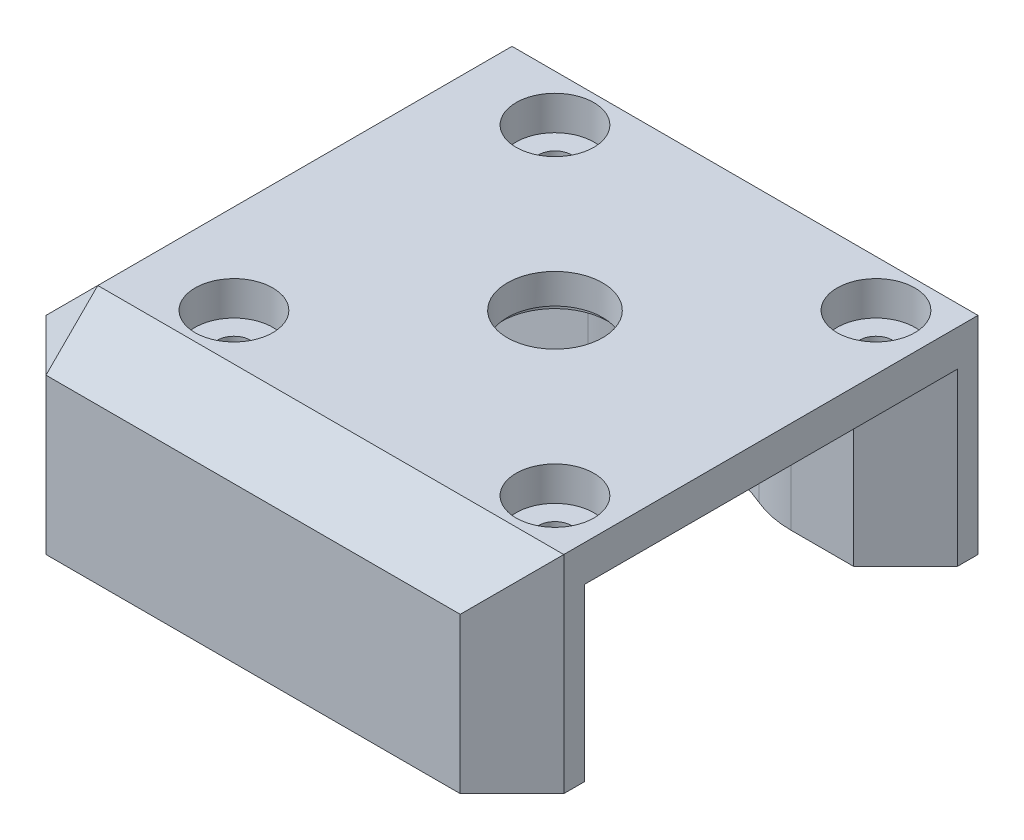
ISO-10303-21;
HEADER;
FILE_DESCRIPTION(('STEP AP214'),'2;1');
FILE_NAME('part.step','',(''),(''),'','','');
FILE_SCHEMA(('AUTOMOTIVE_DESIGN { 1 0 10303 214 1 1 1 1 }'));
ENDSEC;
DATA;
#1=APPLICATION_CONTEXT('core data for automotive mechanical design processes');
#2=APPLICATION_PROTOCOL_DEFINITION('international standard','automotive_design',2000,#1);
#3=PRODUCT_CONTEXT('',#1,'mechanical');
#4=PRODUCT('Part','Part','',(#3));
#5=PRODUCT_RELATED_PRODUCT_CATEGORY('part','',(#4));
#6=PRODUCT_DEFINITION_FORMATION('','',#4);
#7=PRODUCT_DEFINITION_CONTEXT('part definition',#1,'design');
#8=PRODUCT_DEFINITION('design','',#6,#7);
#9=PRODUCT_DEFINITION_SHAPE('','',#8);
#10=(LENGTH_UNIT() NAMED_UNIT(*) SI_UNIT(.MILLI.,.METRE.));
#11=(NAMED_UNIT(*) PLANE_ANGLE_UNIT() SI_UNIT($,.RADIAN.));
#12=(NAMED_UNIT(*) SI_UNIT($,.STERADIAN.) SOLID_ANGLE_UNIT());
#13=UNCERTAINTY_MEASURE_WITH_UNIT(LENGTH_MEASURE(1.E-05),#10,'distance_accuracy_value','');
#14=(GEOMETRIC_REPRESENTATION_CONTEXT(3) GLOBAL_UNCERTAINTY_ASSIGNED_CONTEXT((#13)) GLOBAL_UNIT_ASSIGNED_CONTEXT((#10,
#11,#12)) REPRESENTATION_CONTEXT('',''));
#15=CARTESIAN_POINT('',(0.,0.,0.));
#16=DIRECTION('',(0.,0.,1.));
#17=DIRECTION('',(1.,0.,0.));
#18=AXIS2_PLACEMENT_3D('',#15,#16,#17);
#19=CARTESIAN_POINT('',(5.,16.5,-12.));
#20=DIRECTION('',(0.,0.,1.));
#21=DIRECTION('',(1.,0.,0.));
#22=AXIS2_PLACEMENT_3D('',#19,#20,#21);
#23=PLANE('',#22);
#24=DIRECTION('',(-1.,0.,0.));
#25=VECTOR('',#24,1.);
#26=CARTESIAN_POINT('',(5.,16.5,-12.));
#27=LINE('',#26,#25);
#28=CARTESIAN_POINT('',(19.3520410288675,16.5,-12.));
#29=VERTEX_POINT('',#28);
#30=CARTESIAN_POINT('',(5.,16.5,-12.));
#31=VERTEX_POINT('',#30);
#32=EDGE_CURVE('E218',#29,#31,#27,.T.);
#33=ORIENTED_EDGE('',*,*,#32,.F.);
#34=DIRECTION('',(0.,-1.,0.));
#35=VECTOR('',#34,1.);
#36=CARTESIAN_POINT('',(19.3520410288675,16.5,-12.));
#37=LINE('',#36,#35);
#38=CARTESIAN_POINT('',(19.3520410288675,0.,-12.));
#39=VERTEX_POINT('',#38);
#40=EDGE_CURVE('E328',#29,#39,#37,.T.);
#41=ORIENTED_EDGE('',*,*,#40,.T.);
#42=DIRECTION('',(-1.,0.,0.));
#43=VECTOR('',#42,1.);
#44=CARTESIAN_POINT('',(5.,0.,-12.));
#45=LINE('',#44,#43);
#46=CARTESIAN_POINT('',(5.,0.,-12.));
#47=VERTEX_POINT('',#46);
#48=EDGE_CURVE('E223',#39,#47,#45,.T.);
#49=ORIENTED_EDGE('',*,*,#48,.T.);
#50=DIRECTION('',(0.,-1.,0.));
#51=VECTOR('',#50,1.);
#52=CARTESIAN_POINT('',(5.,16.5,-12.));
#53=LINE('',#52,#51);
#54=EDGE_CURVE('E204',#31,#47,#53,.T.);
#55=ORIENTED_EDGE('',*,*,#54,.F.);
#56=EDGE_LOOP('',(#33,#41,#49,#55));
#57=FACE_BOUND('',#56,.T.);
#58=ADVANCED_FACE('F41',(#57),#23,.F.);
#59=CARTESIAN_POINT('',(5.,16.5,-38.));
#60=DIRECTION('',(0.,0.,-1.));
#61=DIRECTION('',(-1.,0.,0.));
#62=AXIS2_PLACEMENT_3D('',#59,#60,#61);
#63=PLANE('',#62);
#64=DIRECTION('',(1.,0.,0.));
#65=VECTOR('',#64,1.);
#66=CARTESIAN_POINT('',(5.,16.5,-38.));
#67=LINE('',#66,#65);
#68=CARTESIAN_POINT('',(38.9479589711328,16.5,-38.));
#69=VERTEX_POINT('',#68);
#70=CARTESIAN_POINT('',(45.,16.5,-38.));
#71=VERTEX_POINT('',#70);
#72=EDGE_CURVE('E213',#69,#71,#67,.T.);
#73=ORIENTED_EDGE('',*,*,#72,.F.);
#74=DIRECTION('',(0.,-1.,0.));
#75=VECTOR('',#74,1.);
#76=CARTESIAN_POINT('',(38.9479589711328,16.5,-38.));
#77=LINE('',#76,#75);
#78=CARTESIAN_POINT('',(38.9479589711328,0.,-38.));
#79=VERTEX_POINT('',#78);
#80=EDGE_CURVE('E389',#69,#79,#77,.T.);
#81=ORIENTED_EDGE('',*,*,#80,.T.);
#82=DIRECTION('',(1.,0.,0.));
#83=VECTOR('',#82,1.);
#84=CARTESIAN_POINT('',(5.,0.,-38.));
#85=LINE('',#84,#83);
#86=CARTESIAN_POINT('',(45.,0.,-38.));
#87=VERTEX_POINT('',#86);
#88=EDGE_CURVE('E233',#79,#87,#85,.T.);
#89=ORIENTED_EDGE('',*,*,#88,.T.);
#90=DIRECTION('',(0.,1.,0.));
#91=VECTOR('',#90,1.);
#92=CARTESIAN_POINT('',(45.,16.5,-38.));
#93=LINE('',#92,#91);
#94=EDGE_CURVE('E292',#87,#71,#93,.T.);
#95=ORIENTED_EDGE('',*,*,#94,.T.);
#96=EDGE_LOOP('',(#73,#81,#89,#95));
#97=FACE_BOUND('',#96,.T.);
#98=ADVANCED_FACE('F498',(#97),#63,.F.);
#99=CARTESIAN_POINT('',(13.65,20.,-40.5));
#100=DIRECTION('',(0.,-1.,0.));
#101=DIRECTION('',(0.,0.,-1.));
#102=AXIS2_PLACEMENT_3D('',#99,#100,#101);
#103=CYLINDRICAL_SURFACE('',#102,1.6);
#104=CARTESIAN_POINT('',(13.65,0.,-40.5));
#105=DIRECTION('',(0.,1.,0.));
#106=DIRECTION('',(0.,0.,1.));
#107=AXIS2_PLACEMENT_3D('',#104,#105,#106);
#108=CIRCLE('',#107,1.6);
#109=CARTESIAN_POINT('',(13.65,0.,-38.9));
#110=VERTEX_POINT('',#109);
#111=EDGE_CURVE('E246',#110,#110,#108,.T.);
#112=ORIENTED_EDGE('',*,*,#111,.F.);
#113=EDGE_LOOP('',(#112));
#114=FACE_BOUND('',#113,.T.);
#115=CARTESIAN_POINT('',(13.65,16.7,-40.5));
#116=DIRECTION('',(0.,1.,0.));
#117=DIRECTION('',(0.,0.,1.));
#118=AXIS2_PLACEMENT_3D('',#115,#116,#117);
#119=CIRCLE('',#118,1.6);
#120=CARTESIAN_POINT('',(13.65,16.7,-38.9));
#121=VERTEX_POINT('',#120);
#122=EDGE_CURVE('E333',#121,#121,#119,.T.);
#123=ORIENTED_EDGE('',*,*,#122,.T.);
#124=EDGE_LOOP('',(#123));
#125=FACE_BOUND('',#124,.T.);
#126=ADVANCED_FACE('F505',(#114,#125),#103,.F.);
#127=CARTESIAN_POINT('',(44.65,20.,-40.5));
#128=DIRECTION('',(0.,-1.,0.));
#129=DIRECTION('',(0.,0.,-1.));
#130=AXIS2_PLACEMENT_3D('',#127,#128,#129);
#131=CYLINDRICAL_SURFACE('',#130,1.6);
#132=CARTESIAN_POINT('',(44.65,0.,-40.5));
#133=DIRECTION('',(0.,1.,0.));
#134=DIRECTION('',(0.,0.,1.));
#135=AXIS2_PLACEMENT_3D('',#132,#133,#134);
#136=CIRCLE('',#135,1.6);
#137=CARTESIAN_POINT('',(44.65,0.,-38.9));
#138=VERTEX_POINT('',#137);
#139=EDGE_CURVE('E243',#138,#138,#136,.T.);
#140=ORIENTED_EDGE('',*,*,#139,.F.);
#141=EDGE_LOOP('',(#140));
#142=FACE_BOUND('',#141,.T.);
#143=CARTESIAN_POINT('',(44.65,16.7,-40.5));
#144=DIRECTION('',(0.,1.,0.));
#145=DIRECTION('',(0.,0.,1.));
#146=AXIS2_PLACEMENT_3D('',#143,#144,#145);
#147=CIRCLE('',#146,1.6);
#148=CARTESIAN_POINT('',(44.65,16.7,-38.9));
#149=VERTEX_POINT('',#148);
#150=EDGE_CURVE('E362',#149,#149,#147,.T.);
#151=ORIENTED_EDGE('',*,*,#150,.T.);
#152=EDGE_LOOP('',(#151));
#153=FACE_BOUND('',#152,.T.);
#154=ADVANCED_FACE('F530',(#142,#153),#131,.F.);
#155=CARTESIAN_POINT('',(44.6500000000003,20.,-9.5));
#156=DIRECTION('',(0.,-1.,0.));
#157=DIRECTION('',(0.,0.,-1.));
#158=AXIS2_PLACEMENT_3D('',#155,#156,#157);
#159=CYLINDRICAL_SURFACE('',#158,1.6);
#160=CARTESIAN_POINT('',(44.6500000000003,0.,-9.5));
#161=DIRECTION('',(0.,1.,0.));
#162=DIRECTION('',(0.,0.,1.));
#163=AXIS2_PLACEMENT_3D('',#160,#161,#162);
#164=CIRCLE('',#163,1.6);
#165=CARTESIAN_POINT('',(44.6500000000003,0.,-7.9));
#166=VERTEX_POINT('',#165);
#167=EDGE_CURVE('E240',#166,#166,#164,.T.);
#168=ORIENTED_EDGE('',*,*,#167,.F.);
#169=EDGE_LOOP('',(#168));
#170=FACE_BOUND('',#169,.T.);
#171=CARTESIAN_POINT('',(44.6500000000003,16.7,-9.5));
#172=DIRECTION('',(0.,1.,0.));
#173=DIRECTION('',(0.,0.,1.));
#174=AXIS2_PLACEMENT_3D('',#171,#172,#173);
#175=CIRCLE('',#174,1.6);
#176=CARTESIAN_POINT('',(44.6500000000003,16.7,-7.9));
#177=VERTEX_POINT('',#176);
#178=EDGE_CURVE('E358',#177,#177,#175,.T.);
#179=ORIENTED_EDGE('',*,*,#178,.T.);
#180=EDGE_LOOP('',(#179));
#181=FACE_BOUND('',#180,.T.);
#182=ADVANCED_FACE('F526',(#170,#181),#159,.F.);
#183=CARTESIAN_POINT('',(13.6500000000003,20.,-9.5));
#184=DIRECTION('',(0.,-1.,0.));
#185=DIRECTION('',(0.,0.,-1.));
#186=AXIS2_PLACEMENT_3D('',#183,#184,#185);
#187=CYLINDRICAL_SURFACE('',#186,1.6);
#188=CARTESIAN_POINT('',(13.6500000000003,0.,-9.5));
#189=DIRECTION('',(0.,1.,0.));
#190=DIRECTION('',(0.,0.,1.));
#191=AXIS2_PLACEMENT_3D('',#188,#189,#190);
#192=CIRCLE('',#191,1.6);
#193=CARTESIAN_POINT('',(13.6500000000003,0.,-7.9));
#194=VERTEX_POINT('',#193);
#195=EDGE_CURVE('E236',#194,#194,#192,.T.);
#196=ORIENTED_EDGE('',*,*,#195,.F.);
#197=EDGE_LOOP('',(#196));
#198=FACE_BOUND('',#197,.T.);
#199=CARTESIAN_POINT('',(13.6500000000003,16.7,-9.5));
#200=DIRECTION('',(0.,1.,0.));
#201=DIRECTION('',(0.,0.,1.));
#202=AXIS2_PLACEMENT_3D('',#199,#200,#201);
#203=CIRCLE('',#202,1.6);
#204=CARTESIAN_POINT('',(13.6500000000003,16.7,-7.9));
#205=VERTEX_POINT('',#204);
#206=EDGE_CURVE('E355',#205,#205,#203,.T.);
#207=ORIENTED_EDGE('',*,*,#206,.T.);
#208=EDGE_LOOP('',(#207));
#209=FACE_BOUND('',#208,.T.);
#210=ADVANCED_FACE('F522',(#198,#209),#187,.F.);
#211=CARTESIAN_POINT('',(29.1500000000002,5.,-25.));
#212=DIRECTION('',(0.,1.,0.));
#213=DIRECTION('',(0.,0.,1.));
#214=AXIS2_PLACEMENT_3D('',#211,#212,#213);
#215=CYLINDRICAL_SURFACE('',#214,4.6);
#216=CARTESIAN_POINT('',(29.1500000000002,20.,-25.));
#217=DIRECTION('',(0.,1.,0.));
#218=DIRECTION('',(0.,0.,1.));
#219=AXIS2_PLACEMENT_3D('',#216,#217,#218);
#220=CIRCLE('',#219,4.6);
#221=CARTESIAN_POINT('',(29.1500000000002,20.,-20.4));
#222=VERTEX_POINT('',#221);
#223=EDGE_CURVE('E226',#222,#222,#220,.T.);
#224=ORIENTED_EDGE('',*,*,#223,.T.);
#225=EDGE_LOOP('',(#224));
#226=FACE_BOUND('',#225,.T.);
#227=CARTESIAN_POINT('',(29.1500000000002,17.1,-25.));
#228=DIRECTION('',(0.,-1.,0.));
#229=DIRECTION('',(0.,0.,-1.));
#230=AXIS2_PLACEMENT_3D('',#227,#228,#229);
#231=CIRCLE('',#230,4.6);
#232=CARTESIAN_POINT('',(29.1500000000002,17.1,-29.6));
#233=VERTEX_POINT('',#232);
#234=EDGE_CURVE('E266',#233,#233,#231,.F.);
#235=ORIENTED_EDGE('',*,*,#234,.F.);
#236=EDGE_LOOP('',(#235));
#237=FACE_BOUND('',#236,.T.);
#238=ADVANCED_FACE('F525',(#226,#237),#215,.F.);
#239=CARTESIAN_POINT('',(0.,20.,0.));
#240=DIRECTION('',(0.,-1.,0.));
#241=DIRECTION('',(0.,0.,-1.));
#242=AXIS2_PLACEMENT_3D('',#239,#240,#241);
#243=PLANE('',#242);
#244=CARTESIAN_POINT('',(13.6500000000003,20.,-9.5));
#245=DIRECTION('',(0.,1.,0.));
#246=DIRECTION('',(0.,0.,1.));
#247=AXIS2_PLACEMENT_3D('',#244,#245,#246);
#248=CIRCLE('',#247,3.75);
#249=CARTESIAN_POINT('',(13.6500000000003,20.,-5.75));
#250=VERTEX_POINT('',#249);
#251=EDGE_CURVE('E408',#250,#250,#248,.T.);
#252=ORIENTED_EDGE('',*,*,#251,.F.);
#253=EDGE_LOOP('',(#252));
#254=FACE_BOUND('',#253,.T.);
#255=CARTESIAN_POINT('',(44.6500000000003,20.,-9.5));
#256=DIRECTION('',(0.,1.,0.));
#257=DIRECTION('',(0.,0.,1.));
#258=AXIS2_PLACEMENT_3D('',#255,#256,#257);
#259=CIRCLE('',#258,3.75);
#260=CARTESIAN_POINT('',(44.6500000000003,20.,-5.75));
#261=VERTEX_POINT('',#260);
#262=EDGE_CURVE('E606',#261,#261,#259,.T.);
#263=ORIENTED_EDGE('',*,*,#262,.F.);
#264=EDGE_LOOP('',(#263));
#265=FACE_BOUND('',#264,.T.);
#266=CARTESIAN_POINT('',(44.65,20.,-40.5));
#267=DIRECTION('',(0.,1.,0.));
#268=DIRECTION('',(0.,0.,1.));
#269=AXIS2_PLACEMENT_3D('',#266,#267,#268);
#270=CIRCLE('',#269,3.75);
#271=CARTESIAN_POINT('',(44.65,20.,-36.75));
#272=VERTEX_POINT('',#271);
#273=EDGE_CURVE('E600',#272,#272,#270,.T.);
#274=ORIENTED_EDGE('',*,*,#273,.F.);
#275=EDGE_LOOP('',(#274));
#276=FACE_BOUND('',#275,.T.);
#277=CARTESIAN_POINT('',(13.65,20.,-40.5));
#278=DIRECTION('',(0.,1.,0.));
#279=DIRECTION('',(0.,0.,1.));
#280=AXIS2_PLACEMENT_3D('',#277,#278,#279);
#281=CIRCLE('',#280,3.75);
#282=CARTESIAN_POINT('',(13.65,20.,-36.75));
#283=VERTEX_POINT('',#282);
#284=EDGE_CURVE('E599',#283,#283,#281,.T.);
#285=ORIENTED_EDGE('',*,*,#284,.F.);
#286=EDGE_LOOP('',(#285));
#287=FACE_BOUND('',#286,.T.);
#288=ORIENTED_EDGE('',*,*,#223,.F.);
#289=EDGE_LOOP('',(#288));
#290=FACE_BOUND('',#289,.T.);
#291=DIRECTION('',(0.,0.,-1.));
#292=VECTOR('',#291,1.);
#293=CARTESIAN_POINT('',(50.,20.,0.));
#294=LINE('',#293,#292);
#295=CARTESIAN_POINT('',(50.,20.,-5.00000000000002));
#296=VERTEX_POINT('',#295);
#297=CARTESIAN_POINT('',(50.,20.,-45.));
#298=VERTEX_POINT('',#297);
#299=EDGE_CURVE('E250',#296,#298,#294,.T.);
#300=ORIENTED_EDGE('',*,*,#299,.T.);
#301=DIRECTION('',(-1.,0.,0.));
#302=VECTOR('',#301,1.);
#303=CARTESIAN_POINT('',(0.,20.,-45.));
#304=LINE('',#303,#302);
#305=CARTESIAN_POINT('',(5.,20.,-45.));
#306=VERTEX_POINT('',#305);
#307=EDGE_CURVE('E309',#298,#306,#304,.T.);
#308=ORIENTED_EDGE('',*,*,#307,.T.);
#309=DIRECTION('',(0.,0.,1.));
#310=VECTOR('',#309,1.);
#311=CARTESIAN_POINT('',(5.,20.,0.));
#312=LINE('',#311,#310);
#313=CARTESIAN_POINT('',(5.,20.,-5.00000000000002));
#314=VERTEX_POINT('',#313);
#315=EDGE_CURVE('E307',#306,#314,#312,.T.);
#316=ORIENTED_EDGE('',*,*,#315,.T.);
#317=DIRECTION('',(1.,0.,0.));
#318=VECTOR('',#317,1.);
#319=CARTESIAN_POINT('',(0.,20.,-5.00000000000002));
#320=LINE('',#319,#318);
#321=EDGE_CURVE('E305',#314,#296,#320,.T.);
#322=ORIENTED_EDGE('',*,*,#321,.T.);
#323=EDGE_LOOP('',(#300,#308,#316,#322));
#324=FACE_BOUND('',#323,.T.);
#325=ADVANCED_FACE('F538',(#254,#265,#276,#287,#290,#324),#243,.F.);
#326=CARTESIAN_POINT('',(0.,0.,0.));
#327=DIRECTION('',(0.,-1.,0.));
#328=DIRECTION('',(0.,0.,-1.));
#329=AXIS2_PLACEMENT_3D('',#326,#327,#328);
#330=PLANE('',#329);
#331=ORIENTED_EDGE('',*,*,#48,.F.);
#332=CARTESIAN_POINT('',(19.3520410288675,0.,-2.));
#333=DIRECTION('',(0.,-1.,0.));
#334=DIRECTION('',(0.,0.,-1.));
#335=AXIS2_PLACEMENT_3D('',#332,#333,#334);
#336=CIRCLE('',#335,10.);
#337=CARTESIAN_POINT('',(23.2712246173205,0.,-11.2));
#338=VERTEX_POINT('',#337);
#339=EDGE_CURVE('E375',#39,#338,#336,.T.);
#340=ORIENTED_EDGE('',*,*,#339,.T.);
#341=CARTESIAN_POINT('',(29.1500000000002,0.,-25.));
#342=DIRECTION('',(0.,-1.,0.));
#343=DIRECTION('',(0.,0.,-1.));
#344=AXIS2_PLACEMENT_3D('',#341,#342,#343);
#345=CIRCLE('',#344,15.);
#346=CARTESIAN_POINT('',(35.0287753826798,0.,-11.2));
#347=VERTEX_POINT('',#346);
#348=EDGE_CURVE('E418',#347,#338,#345,.T.);
#349=ORIENTED_EDGE('',*,*,#348,.F.);
#350=CARTESIAN_POINT('',(38.9479589711329,0.,-2.));
#351=DIRECTION('',(0.,-1.,0.));
#352=DIRECTION('',(0.,0.,-1.));
#353=AXIS2_PLACEMENT_3D('',#350,#351,#352);
#354=CIRCLE('',#353,10.);
#355=CARTESIAN_POINT('',(38.9479589711328,0.,-12.));
#356=VERTEX_POINT('',#355);
#357=EDGE_CURVE('E373',#347,#356,#354,.T.);
#358=ORIENTED_EDGE('',*,*,#357,.T.);
#359=CARTESIAN_POINT('',(45.,0.,-12.));
#360=VERTEX_POINT('',#359);
#361=EDGE_CURVE('E220',#360,#356,#45,.T.);
#362=ORIENTED_EDGE('',*,*,#361,.F.);
#363=DIRECTION('',(-0.707106781186546,0.,-0.707106781186549));
#364=VECTOR('',#363,1.);
#365=CARTESIAN_POINT('',(28.5000000000001,0.,-28.5));
#366=LINE('',#365,#364);
#367=CARTESIAN_POINT('',(50.,0.,-6.99999999999999));
#368=VERTEX_POINT('',#367);
#369=EDGE_CURVE('E287',#360,#368,#366,.F.);
#370=ORIENTED_EDGE('',*,*,#369,.T.);
#371=DIRECTION('',(0.,0.,-1.));
#372=VECTOR('',#371,1.);
#373=CARTESIAN_POINT('',(50.,0.,0.));
#374=LINE('',#373,#372);
#375=CARTESIAN_POINT('',(50.,0.,-5.00000000000002));
#376=VERTEX_POINT('',#375);
#377=EDGE_CURVE('E263',#376,#368,#374,.T.);
#378=ORIENTED_EDGE('',*,*,#377,.F.);
#379=DIRECTION('',(0.707106781186547,0.,-0.707106781186549));
#380=VECTOR('',#379,1.);
#381=CARTESIAN_POINT('',(22.5000000000001,0.,22.5));
#382=LINE('',#381,#380);
#383=CARTESIAN_POINT('',(45.,0.,0.));
#384=VERTEX_POINT('',#383);
#385=EDGE_CURVE('E281',#376,#384,#382,.F.);
#386=ORIENTED_EDGE('',*,*,#385,.T.);
#387=DIRECTION('',(1.,0.,0.));
#388=VECTOR('',#387,1.);
#389=CARTESIAN_POINT('',(0.,0.,0.));
#390=LINE('',#389,#388);
#391=CARTESIAN_POINT('',(5.,0.,0.));
#392=VERTEX_POINT('',#391);
#393=EDGE_CURVE('E257',#392,#384,#390,.T.);
#394=ORIENTED_EDGE('',*,*,#393,.F.);
#395=DIRECTION('',(0.707106781186547,0.,0.707106781186549));
#396=VECTOR('',#395,1.);
#397=CARTESIAN_POINT('',(2.50000000000001,0.,-2.5));
#398=LINE('',#397,#396);
#399=CARTESIAN_POINT('',(0.,0.,-5.00000000000002));
#400=VERTEX_POINT('',#399);
#401=EDGE_CURVE('E279',#392,#400,#398,.F.);
#402=ORIENTED_EDGE('',*,*,#401,.T.);
#403=DIRECTION('',(0.,0.,1.));
#404=VECTOR('',#403,1.);
#405=CARTESIAN_POINT('',(0.,0.,0.));
#406=LINE('',#405,#404);
#407=CARTESIAN_POINT('',(0.,0.,-45.));
#408=VERTEX_POINT('',#407);
#409=EDGE_CURVE('E249',#408,#400,#406,.T.);
#410=ORIENTED_EDGE('',*,*,#409,.F.);
#411=DIRECTION('',(-0.707106781186547,0.,0.707106781186549));
#412=VECTOR('',#411,1.);
#413=CARTESIAN_POINT('',(-22.5,0.,-22.4999999999999));
#414=LINE('',#413,#412);
#415=CARTESIAN_POINT('',(5.,0.,-50.));
#416=VERTEX_POINT('',#415);
#417=EDGE_CURVE('E283',#408,#416,#414,.F.);
#418=ORIENTED_EDGE('',*,*,#417,.T.);
#419=DIRECTION('',(-1.,0.,0.));
#420=VECTOR('',#419,1.);
#421=CARTESIAN_POINT('',(0.,0.,-50.));
#422=LINE('',#421,#420);
#423=CARTESIAN_POINT('',(45.,0.,-50.));
#424=VERTEX_POINT('',#423);
#425=EDGE_CURVE('E254',#424,#416,#422,.T.);
#426=ORIENTED_EDGE('',*,*,#425,.F.);
#427=DIRECTION('',(-0.707106781186547,0.,-0.707106781186549));
#428=VECTOR('',#427,1.);
#429=CARTESIAN_POINT('',(47.5000000000001,0.,-47.4999999999999));
#430=LINE('',#429,#428);
#431=CARTESIAN_POINT('',(50.,0.,-45.));
#432=VERTEX_POINT('',#431);
#433=EDGE_CURVE('E285',#424,#432,#430,.F.);
#434=ORIENTED_EDGE('',*,*,#433,.T.);
#435=CARTESIAN_POINT('',(50.,0.,-43.));
#436=VERTEX_POINT('',#435);
#437=EDGE_CURVE('E260',#436,#432,#374,.T.);
#438=ORIENTED_EDGE('',*,*,#437,.F.);
#439=DIRECTION('',(0.707106781186549,0.,-0.707106781186546));
#440=VECTOR('',#439,1.);
#441=CARTESIAN_POINT('',(3.49999999999989,0.,3.49999999999991));
#442=LINE('',#441,#440);
#443=EDGE_CURVE('E289',#436,#87,#442,.F.);
#444=ORIENTED_EDGE('',*,*,#443,.T.);
#445=ORIENTED_EDGE('',*,*,#88,.F.);
#446=CARTESIAN_POINT('',(38.9479589711328,0.,-48.));
#447=DIRECTION('',(0.,-1.,0.));
#448=DIRECTION('',(0.,0.,-1.));
#449=AXIS2_PLACEMENT_3D('',#446,#447,#448);
#450=CIRCLE('',#449,10.);
#451=CARTESIAN_POINT('',(35.0287753826798,0.,-38.8));
#452=VERTEX_POINT('',#451);
#453=EDGE_CURVE('E369',#79,#452,#450,.T.);
#454=ORIENTED_EDGE('',*,*,#453,.T.);
#455=CARTESIAN_POINT('',(23.2712246173206,0.,-38.8));
#456=VERTEX_POINT('',#455);
#457=EDGE_CURVE('E590',#456,#452,#345,.T.);
#458=ORIENTED_EDGE('',*,*,#457,.F.);
#459=CARTESIAN_POINT('',(19.3520410288675,0.,-48.));
#460=DIRECTION('',(0.,-1.,0.));
#461=DIRECTION('',(0.,0.,-1.));
#462=AXIS2_PLACEMENT_3D('',#459,#460,#461);
#463=CIRCLE('',#462,10.);
#464=CARTESIAN_POINT('',(19.3520410288675,0.,-38.));
#465=VERTEX_POINT('',#464);
#466=EDGE_CURVE('E371',#456,#465,#463,.T.);
#467=ORIENTED_EDGE('',*,*,#466,.T.);
#468=CARTESIAN_POINT('',(5.,0.,-38.));
#469=VERTEX_POINT('',#468);
#470=EDGE_CURVE('E234',#469,#465,#85,.T.);
#471=ORIENTED_EDGE('',*,*,#470,.F.);
#472=DIRECTION('',(0.,0.,-1.));
#473=VECTOR('',#472,1.);
#474=CARTESIAN_POINT('',(5.,0.,-12.));
#475=LINE('',#474,#473);
#476=EDGE_CURVE('E200',#47,#469,#475,.T.);
#477=ORIENTED_EDGE('',*,*,#476,.F.);
#478=EDGE_LOOP('',(#331,#340,#349,#358,#362,#370,#378,#386,#394,#402,#410,#418,#426,#434,#438,
#444,#445,#454,#458,#467,#471,#477));
#479=FACE_BOUND('',#478,.T.);
#480=ORIENTED_EDGE('',*,*,#167,.T.);
#481=EDGE_LOOP('',(#480));
#482=FACE_BOUND('',#481,.T.);
#483=ORIENTED_EDGE('',*,*,#111,.T.);
#484=EDGE_LOOP('',(#483));
#485=FACE_BOUND('',#484,.T.);
#486=ORIENTED_EDGE('',*,*,#139,.T.);
#487=EDGE_LOOP('',(#486));
#488=FACE_BOUND('',#487,.T.);
#489=ORIENTED_EDGE('',*,*,#195,.T.);
#490=EDGE_LOOP('',(#489));
#491=FACE_BOUND('',#490,.T.);
#492=ADVANCED_FACE('F416',(#479,#482,#485,#488,#491),#330,.T.);
#493=CARTESIAN_POINT('',(0.,20.,0.));
#494=DIRECTION('',(1.,0.,0.));
#495=DIRECTION('',(0.,0.,-1.));
#496=AXIS2_PLACEMENT_3D('',#493,#494,#495);
#497=PLANE('',#496);
#498=DIRECTION('',(0.,0.,-1.));
#499=VECTOR('',#498,1.);
#500=CARTESIAN_POINT('',(0.,15.,0.));
#501=LINE('',#500,#499);
#502=CARTESIAN_POINT('',(0.,15.,-5.00000000000002));
#503=VERTEX_POINT('',#502);
#504=CARTESIAN_POINT('',(0.,15.,-45.));
#505=VERTEX_POINT('',#504);
#506=EDGE_CURVE('E313',#503,#505,#501,.T.);
#507=ORIENTED_EDGE('',*,*,#506,.T.);
#508=DIRECTION('',(0.,-1.,0.));
#509=VECTOR('',#508,1.);
#510=CARTESIAN_POINT('',(0.,20.,-45.));
#511=LINE('',#510,#509);
#512=EDGE_CURVE('E315',#505,#408,#511,.T.);
#513=ORIENTED_EDGE('',*,*,#512,.T.);
#514=ORIENTED_EDGE('',*,*,#409,.T.);
#515=DIRECTION('',(0.,1.,0.));
#516=VECTOR('',#515,1.);
#517=CARTESIAN_POINT('',(0.,20.,-5.00000000000002));
#518=LINE('',#517,#516);
#519=EDGE_CURVE('E311',#400,#503,#518,.T.);
#520=ORIENTED_EDGE('',*,*,#519,.T.);
#521=EDGE_LOOP('',(#507,#513,#514,#520));
#522=FACE_BOUND('',#521,.T.);
#523=ADVANCED_FACE('F455',(#522),#497,.F.);
#524=CARTESIAN_POINT('',(0.,20.,0.));
#525=DIRECTION('',(0.,0.,-1.));
#526=DIRECTION('',(-1.,0.,0.));
#527=AXIS2_PLACEMENT_3D('',#524,#525,#526);
#528=PLANE('',#527);
#529=ORIENTED_EDGE('',*,*,#393,.T.);
#530=DIRECTION('',(0.,1.,0.));
#531=VECTOR('',#530,1.);
#532=CARTESIAN_POINT('',(45.,20.,0.));
#533=LINE('',#532,#531);
#534=CARTESIAN_POINT('',(45.,15.,0.));
#535=VERTEX_POINT('',#534);
#536=EDGE_CURVE('E321',#384,#535,#533,.T.);
#537=ORIENTED_EDGE('',*,*,#536,.T.);
#538=DIRECTION('',(-1.,0.,0.));
#539=VECTOR('',#538,1.);
#540=CARTESIAN_POINT('',(0.,15.,0.));
#541=LINE('',#540,#539);
#542=CARTESIAN_POINT('',(5.,15.,0.));
#543=VERTEX_POINT('',#542);
#544=EDGE_CURVE('E319',#535,#543,#541,.T.);
#545=ORIENTED_EDGE('',*,*,#544,.T.);
#546=DIRECTION('',(0.,-1.,0.));
#547=VECTOR('',#546,1.);
#548=CARTESIAN_POINT('',(5.,20.,0.));
#549=LINE('',#548,#547);
#550=EDGE_CURVE('E317',#543,#392,#549,.T.);
#551=ORIENTED_EDGE('',*,*,#550,.T.);
#552=EDGE_LOOP('',(#529,#537,#545,#551));
#553=FACE_BOUND('',#552,.T.);
#554=ADVANCED_FACE('F444',(#553),#528,.F.);
#555=CARTESIAN_POINT('',(50.,20.,0.));
#556=DIRECTION('',(-1.,0.,0.));
#557=DIRECTION('',(0.,0.,1.));
#558=AXIS2_PLACEMENT_3D('',#555,#556,#557);
#559=PLANE('',#558);
#560=DIRECTION('',(0.,0.,1.));
#561=VECTOR('',#560,1.);
#562=CARTESIAN_POINT('',(50.,16.5,-12.));
#563=LINE('',#562,#561);
#564=CARTESIAN_POINT('',(50.,16.5,-43.));
#565=VERTEX_POINT('',#564);
#566=CARTESIAN_POINT('',(50.,16.5,-6.99999999999999));
#567=VERTEX_POINT('',#566);
#568=EDGE_CURVE('E212',#565,#567,#563,.T.);
#569=ORIENTED_EDGE('',*,*,#568,.F.);
#570=DIRECTION('',(0.,-1.,0.));
#571=VECTOR('',#570,1.);
#572=CARTESIAN_POINT('',(50.,20.,-43.));
#573=LINE('',#572,#571);
#574=EDGE_CURVE('E276',#565,#436,#573,.T.);
#575=ORIENTED_EDGE('',*,*,#574,.T.);
#576=ORIENTED_EDGE('',*,*,#437,.T.);
#577=DIRECTION('',(0.,1.,0.));
#578=VECTOR('',#577,1.);
#579=CARTESIAN_POINT('',(50.,20.,-45.));
#580=LINE('',#579,#578);
#581=EDGE_CURVE('E271',#432,#298,#580,.T.);
#582=ORIENTED_EDGE('',*,*,#581,.T.);
#583=ORIENTED_EDGE('',*,*,#299,.F.);
#584=DIRECTION('',(0.,-1.,0.));
#585=VECTOR('',#584,1.);
#586=CARTESIAN_POINT('',(50.,20.,-5.00000000000002));
#587=LINE('',#586,#585);
#588=EDGE_CURVE('E253',#296,#376,#587,.T.);
#589=ORIENTED_EDGE('',*,*,#588,.T.);
#590=ORIENTED_EDGE('',*,*,#377,.T.);
#591=DIRECTION('',(0.,1.,0.));
#592=VECTOR('',#591,1.);
#593=CARTESIAN_POINT('',(50.,20.,-6.99999999999999));
#594=LINE('',#593,#592);
#595=EDGE_CURVE('E273',#368,#567,#594,.T.);
#596=ORIENTED_EDGE('',*,*,#595,.T.);
#597=EDGE_LOOP('',(#569,#575,#576,#582,#583,#589,#590,#596));
#598=FACE_BOUND('',#597,.T.);
#599=ADVANCED_FACE('F430',(#598),#559,.F.);
#600=CARTESIAN_POINT('',(0.,20.,-50.));
#601=DIRECTION('',(0.,0.,1.));
#602=DIRECTION('',(1.,0.,0.));
#603=AXIS2_PLACEMENT_3D('',#600,#601,#602);
#604=PLANE('',#603);
#605=DIRECTION('',(1.,0.,0.));
#606=VECTOR('',#605,1.);
#607=CARTESIAN_POINT('',(0.,15.,-50.));
#608=LINE('',#607,#606);
#609=CARTESIAN_POINT('',(5.,15.,-50.));
#610=VERTEX_POINT('',#609);
#611=CARTESIAN_POINT('',(45.,15.,-50.));
#612=VERTEX_POINT('',#611);
#613=EDGE_CURVE('E300',#610,#612,#608,.T.);
#614=ORIENTED_EDGE('',*,*,#613,.T.);
#615=DIRECTION('',(0.,-1.,0.));
#616=VECTOR('',#615,1.);
#617=CARTESIAN_POINT('',(45.,20.,-50.));
#618=LINE('',#617,#616);
#619=EDGE_CURVE('E302',#612,#424,#618,.T.);
#620=ORIENTED_EDGE('',*,*,#619,.T.);
#621=ORIENTED_EDGE('',*,*,#425,.T.);
#622=DIRECTION('',(0.,1.,0.));
#623=VECTOR('',#622,1.);
#624=CARTESIAN_POINT('',(5.,20.,-50.));
#625=LINE('',#624,#623);
#626=EDGE_CURVE('E298',#416,#610,#625,.T.);
#627=ORIENTED_EDGE('',*,*,#626,.T.);
#628=EDGE_LOOP('',(#614,#620,#621,#627));
#629=FACE_BOUND('',#628,.T.);
#630=ADVANCED_FACE('F476',(#629),#604,.F.);
#631=CARTESIAN_POINT('',(5.,16.5,-12.));
#632=DIRECTION('',(-1.,0.,0.));
#633=DIRECTION('',(0.,0.,1.));
#634=AXIS2_PLACEMENT_3D('',#631,#632,#633);
#635=PLANE('',#634);
#636=ORIENTED_EDGE('',*,*,#476,.T.);
#637=DIRECTION('',(0.,-1.,0.));
#638=VECTOR('',#637,1.);
#639=CARTESIAN_POINT('',(5.,16.5,-38.));
#640=LINE('',#639,#638);
#641=CARTESIAN_POINT('',(5.,16.5,-38.));
#642=VERTEX_POINT('',#641);
#643=EDGE_CURVE('E193',#642,#469,#640,.T.);
#644=ORIENTED_EDGE('',*,*,#643,.F.);
#645=DIRECTION('',(0.,0.,-1.));
#646=VECTOR('',#645,1.);
#647=CARTESIAN_POINT('',(5.,16.5,-12.));
#648=LINE('',#647,#646);
#649=EDGE_CURVE('E198',#31,#642,#648,.T.);
#650=ORIENTED_EDGE('',*,*,#649,.F.);
#651=ORIENTED_EDGE('',*,*,#54,.T.);
#652=EDGE_LOOP('',(#636,#644,#650,#651));
#653=FACE_BOUND('',#652,.T.);
#654=ADVANCED_FACE('F195',(#653),#635,.F.);
#655=ORIENTED_EDGE('',*,*,#361,.T.);
#656=DIRECTION('',(0.,-1.,0.));
#657=VECTOR('',#656,1.);
#658=CARTESIAN_POINT('',(38.9479589711329,16.5,-12.));
#659=LINE('',#658,#657);
#660=CARTESIAN_POINT('',(38.9479589711328,16.5,-12.));
#661=VERTEX_POINT('',#660);
#662=EDGE_CURVE('E381',#356,#661,#659,.F.);
#663=ORIENTED_EDGE('',*,*,#662,.T.);
#664=CARTESIAN_POINT('',(45.,16.5,-12.));
#665=VERTEX_POINT('',#664);
#666=EDGE_CURVE('E205',#665,#661,#27,.T.);
#667=ORIENTED_EDGE('',*,*,#666,.F.);
#668=DIRECTION('',(0.,-1.,0.));
#669=VECTOR('',#668,1.);
#670=CARTESIAN_POINT('',(45.,16.5,-12.));
#671=LINE('',#670,#669);
#672=EDGE_CURVE('E295',#665,#360,#671,.T.);
#673=ORIENTED_EDGE('',*,*,#672,.T.);
#674=EDGE_LOOP('',(#655,#663,#667,#673));
#675=FACE_BOUND('',#674,.T.);
#676=ADVANCED_FACE('F420',(#675),#23,.F.);
#677=ORIENTED_EDGE('',*,*,#470,.T.);
#678=DIRECTION('',(0.,-1.,0.));
#679=VECTOR('',#678,1.);
#680=CARTESIAN_POINT('',(19.3520410288675,16.5,-38.));
#681=LINE('',#680,#679);
#682=CARTESIAN_POINT('',(19.3520410288675,16.5,-38.));
#683=VERTEX_POINT('',#682);
#684=EDGE_CURVE('E211',#465,#683,#681,.F.);
#685=ORIENTED_EDGE('',*,*,#684,.T.);
#686=EDGE_CURVE('E208',#642,#683,#67,.T.);
#687=ORIENTED_EDGE('',*,*,#686,.F.);
#688=ORIENTED_EDGE('',*,*,#643,.T.);
#689=EDGE_LOOP('',(#677,#685,#687,#688));
#690=FACE_BOUND('',#689,.T.);
#691=ADVANCED_FACE('F209',(#690),#63,.F.);
#692=CARTESIAN_POINT('',(0.,16.5,0.));
#693=DIRECTION('',(0.,-1.,0.));
#694=DIRECTION('',(0.,0.,-1.));
#695=AXIS2_PLACEMENT_3D('',#692,#693,#694);
#696=PLANE('',#695);
#697=ORIENTED_EDGE('',*,*,#686,.T.);
#698=CARTESIAN_POINT('',(19.3520410288675,16.5,-48.));
#699=DIRECTION('',(0.,-1.,0.));
#700=DIRECTION('',(0.,0.,-1.));
#701=AXIS2_PLACEMENT_3D('',#698,#699,#700);
#702=CIRCLE('',#701,10.);
#703=CARTESIAN_POINT('',(23.2712246173206,16.5,-38.8));
#704=VERTEX_POINT('',#703);
#705=EDGE_CURVE('E49',#683,#704,#702,.F.);
#706=ORIENTED_EDGE('',*,*,#705,.T.);
#707=CARTESIAN_POINT('',(29.1500000000002,16.5,-25.));
#708=DIRECTION('',(0.,-1.,0.));
#709=DIRECTION('',(0.,0.,-1.));
#710=AXIS2_PLACEMENT_3D('',#707,#708,#709);
#711=CIRCLE('',#710,15.);
#712=CARTESIAN_POINT('',(35.0287753826798,16.5,-38.8));
#713=VERTEX_POINT('',#712);
#714=EDGE_CURVE('E409',#713,#704,#711,.F.);
#715=ORIENTED_EDGE('',*,*,#714,.F.);
#716=CARTESIAN_POINT('',(38.9479589711328,16.5,-48.));
#717=DIRECTION('',(0.,-1.,0.));
#718=DIRECTION('',(0.,0.,-1.));
#719=AXIS2_PLACEMENT_3D('',#716,#717,#718);
#720=CIRCLE('',#719,10.);
#721=EDGE_CURVE('E11',#713,#69,#720,.F.);
#722=ORIENTED_EDGE('',*,*,#721,.T.);
#723=ORIENTED_EDGE('',*,*,#72,.T.);
#724=DIRECTION('',(-0.707106781186549,0.,0.707106781186546));
#725=VECTOR('',#724,1.);
#726=CARTESIAN_POINT('',(50.,16.5,-43.));
#727=LINE('',#726,#725);
#728=EDGE_CURVE('E323',#71,#565,#727,.F.);
#729=ORIENTED_EDGE('',*,*,#728,.T.);
#730=ORIENTED_EDGE('',*,*,#568,.T.);
#731=DIRECTION('',(0.707106781186546,0.,0.707106781186549));
#732=VECTOR('',#731,1.);
#733=CARTESIAN_POINT('',(45.,16.5,-12.));
#734=LINE('',#733,#732);
#735=EDGE_CURVE('E326',#567,#665,#734,.F.);
#736=ORIENTED_EDGE('',*,*,#735,.T.);
#737=ORIENTED_EDGE('',*,*,#666,.T.);
#738=CARTESIAN_POINT('',(38.9479589711329,16.5,-2.));
#739=DIRECTION('',(0.,-1.,0.));
#740=DIRECTION('',(0.,0.,-1.));
#741=AXIS2_PLACEMENT_3D('',#738,#739,#740);
#742=CIRCLE('',#741,10.);
#743=CARTESIAN_POINT('',(35.0287753826798,16.5,-11.2));
#744=VERTEX_POINT('',#743);
#745=EDGE_CURVE('E394',#661,#744,#742,.F.);
#746=ORIENTED_EDGE('',*,*,#745,.T.);
#747=CARTESIAN_POINT('',(23.2712246173205,16.5,-11.2));
#748=VERTEX_POINT('',#747);
#749=EDGE_CURVE('E397',#748,#744,#711,.F.);
#750=ORIENTED_EDGE('',*,*,#749,.F.);
#751=CARTESIAN_POINT('',(19.3520410288675,16.5,-2.));
#752=DIRECTION('',(0.,-1.,0.));
#753=DIRECTION('',(0.,0.,-1.));
#754=AXIS2_PLACEMENT_3D('',#751,#752,#753);
#755=CIRCLE('',#754,10.);
#756=EDGE_CURVE('E392',#748,#29,#755,.F.);
#757=ORIENTED_EDGE('',*,*,#756,.T.);
#758=ORIENTED_EDGE('',*,*,#32,.T.);
#759=ORIENTED_EDGE('',*,*,#649,.T.);
#760=EDGE_LOOP('',(#697,#706,#715,#722,#723,#729,#730,#736,#737,#746,#750,#757,#758,#759));
#761=FACE_BOUND('',#760,.T.);
#762=CARTESIAN_POINT('',(29.1500000000002,16.5,-25.));
#763=DIRECTION('',(0.,-1.,0.));
#764=DIRECTION('',(0.,0.,-1.));
#765=AXIS2_PLACEMENT_3D('',#762,#763,#764);
#766=CIRCLE('',#765,5.15000000000001);
#767=CARTESIAN_POINT('',(29.1500000000002,16.5,-30.15));
#768=VERTEX_POINT('',#767);
#769=EDGE_CURVE('E354',#768,#768,#766,.T.);
#770=ORIENTED_EDGE('',*,*,#769,.F.);
#771=EDGE_LOOP('',(#770));
#772=FACE_BOUND('',#771,.T.);
#773=ADVANCED_FACE('F215',(#761,#772),#696,.T.);
#774=CARTESIAN_POINT('',(29.1500000000002,17.1,-25.));
#775=DIRECTION('',(0.,-1.,0.));
#776=DIRECTION('',(0.,0.,-1.));
#777=AXIS2_PLACEMENT_3D('',#774,#775,#776);
#778=PLANE('',#777);
#779=CARTESIAN_POINT('',(29.1500000000002,17.1,-25.));
#780=DIRECTION('',(0.,-1.,0.));
#781=DIRECTION('',(0.,0.,-1.));
#782=AXIS2_PLACEMENT_3D('',#779,#780,#781);
#783=CIRCLE('',#782,5.15000000000001);
#784=CARTESIAN_POINT('',(29.1500000000002,17.1,-30.15));
#785=VERTEX_POINT('',#784);
#786=EDGE_CURVE('E269',#785,#785,#783,.T.);
#787=ORIENTED_EDGE('',*,*,#786,.T.);
#788=EDGE_LOOP('',(#787));
#789=FACE_BOUND('',#788,.T.);
#790=ORIENTED_EDGE('',*,*,#234,.T.);
#791=EDGE_LOOP('',(#790));
#792=FACE_BOUND('',#791,.T.);
#793=ADVANCED_FACE('F623',(#789,#792),#778,.T.);
#794=CARTESIAN_POINT('',(29.1500000000002,17.1,-25.));
#795=DIRECTION('',(0.,-1.,0.));
#796=DIRECTION('',(0.,0.,-1.));
#797=AXIS2_PLACEMENT_3D('',#794,#795,#796);
#798=CYLINDRICAL_SURFACE('',#797,5.15000000000001);
#799=ORIENTED_EDGE('',*,*,#786,.F.);
#800=EDGE_LOOP('',(#799));
#801=FACE_BOUND('',#800,.T.);
#802=ORIENTED_EDGE('',*,*,#769,.T.);
#803=EDGE_LOOP('',(#802));
#804=FACE_BOUND('',#803,.T.);
#805=ADVANCED_FACE('F555',(#801,#804),#798,.F.);
#806=CARTESIAN_POINT('',(50.,20.,-43.));
#807=DIRECTION('',(-0.707106781186546,0.,-0.707106781186549));
#808=DIRECTION('',(0.,-1.,0.));
#809=AXIS2_PLACEMENT_3D('',#806,#807,#808);
#810=PLANE('',#809);
#811=ORIENTED_EDGE('',*,*,#728,.F.);
#812=ORIENTED_EDGE('',*,*,#94,.F.);
#813=ORIENTED_EDGE('',*,*,#443,.F.);
#814=ORIENTED_EDGE('',*,*,#574,.F.);
#815=EDGE_LOOP('',(#811,#812,#813,#814));
#816=FACE_BOUND('',#815,.T.);
#817=ADVANCED_FACE('F550',(#816),#810,.F.);
#818=CARTESIAN_POINT('',(45.,16.5,-12.));
#819=DIRECTION('',(-0.707106781186549,0.,0.707106781186546));
#820=DIRECTION('',(0.,-1.,0.));
#821=AXIS2_PLACEMENT_3D('',#818,#819,#820);
#822=PLANE('',#821);
#823=ORIENTED_EDGE('',*,*,#735,.F.);
#824=ORIENTED_EDGE('',*,*,#595,.F.);
#825=ORIENTED_EDGE('',*,*,#369,.F.);
#826=ORIENTED_EDGE('',*,*,#672,.F.);
#827=EDGE_LOOP('',(#823,#824,#825,#826));
#828=FACE_BOUND('',#827,.T.);
#829=ADVANCED_FACE('F424',(#828),#822,.F.);
#830=CARTESIAN_POINT('',(50.,20.,-5.00000000000002));
#831=DIRECTION('',(-0.707106781186549,0.,-0.707106781186547));
#832=DIRECTION('',(0.,-1.,0.));
#833=AXIS2_PLACEMENT_3D('',#830,#831,#832);
#834=PLANE('',#833);
#835=ORIENTED_EDGE('',*,*,#385,.F.);
#836=ORIENTED_EDGE('',*,*,#588,.F.);
#837=DIRECTION('',(0.577350269189625,0.577350269189625,-0.577350269189627));
#838=VECTOR('',#837,1.);
#839=CARTESIAN_POINT('',(33.3333333333334,3.33333333333336,11.6666666666667));
#840=LINE('',#839,#838);
#841=EDGE_CURVE('E351',#535,#296,#840,.T.);
#842=ORIENTED_EDGE('',*,*,#841,.F.);
#843=ORIENTED_EDGE('',*,*,#536,.F.);
#844=EDGE_LOOP('',(#835,#836,#842,#843));
#845=FACE_BOUND('',#844,.T.);
#846=ADVANCED_FACE('F435',(#845),#834,.F.);
#847=CARTESIAN_POINT('',(0.,20.,-5.00000000000002));
#848=DIRECTION('',(0.,-0.707106781186549,-0.707106781186547));
#849=DIRECTION('',(1.,0.,0.));
#850=AXIS2_PLACEMENT_3D('',#847,#848,#849);
#851=PLANE('',#850);
#852=ORIENTED_EDGE('',*,*,#841,.T.);
#853=ORIENTED_EDGE('',*,*,#321,.F.);
#854=DIRECTION('',(0.,-0.707106781186547,0.707106781186549));
#855=VECTOR('',#854,1.);
#856=CARTESIAN_POINT('',(5.,20.,-5.00000000000002));
#857=LINE('',#856,#855);
#858=EDGE_CURVE('E348',#543,#314,#857,.F.);
#859=ORIENTED_EDGE('',*,*,#858,.F.);
#860=ORIENTED_EDGE('',*,*,#544,.F.);
#861=EDGE_LOOP('',(#852,#853,#859,#860));
#862=FACE_BOUND('',#861,.T.);
#863=ADVANCED_FACE('F440',(#862),#851,.F.);
#864=CARTESIAN_POINT('',(5.,20.,0.));
#865=DIRECTION('',(0.707106781186549,0.,-0.707106781186547));
#866=DIRECTION('',(0.,-1.,0.));
#867=AXIS2_PLACEMENT_3D('',#864,#865,#866);
#868=PLANE('',#867);
#869=ORIENTED_EDGE('',*,*,#401,.F.);
#870=ORIENTED_EDGE('',*,*,#550,.F.);
#871=DIRECTION('',(-0.707106781186546,0.,-0.707106781186548));
#872=VECTOR('',#871,1.);
#873=CARTESIAN_POINT('',(2.5,15.,-2.50000000000001));
#874=LINE('',#873,#872);
#875=EDGE_CURVE('E345',#503,#543,#874,.F.);
#876=ORIENTED_EDGE('',*,*,#875,.F.);
#877=ORIENTED_EDGE('',*,*,#519,.F.);
#878=EDGE_LOOP('',(#869,#870,#876,#877));
#879=FACE_BOUND('',#878,.T.);
#880=ADVANCED_FACE('F449',(#879),#868,.F.);
#881=CARTESIAN_POINT('',(5.,20.,-5.00000000000002));
#882=DIRECTION('',(-0.577350269189627,0.577350269189626,0.577350269189624));
#883=DIRECTION('',(-0.707106781186547,-0.707106781186549,0.));
#884=AXIS2_PLACEMENT_3D('',#881,#882,#883);
#885=PLANE('',#884);
#886=ORIENTED_EDGE('',*,*,#875,.T.);
#887=ORIENTED_EDGE('',*,*,#858,.T.);
#888=DIRECTION('',(0.707106781186546,0.707106781186548,0.));
#889=VECTOR('',#888,1.);
#890=CARTESIAN_POINT('',(5.,20.,-5.00000000000002));
#891=LINE('',#890,#889);
#892=EDGE_CURVE('E342',#503,#314,#891,.T.);
#893=ORIENTED_EDGE('',*,*,#892,.F.);
#894=EDGE_LOOP('',(#886,#887,#893));
#895=FACE_BOUND('',#894,.T.);
#896=ADVANCED_FACE('F764',(#895),#885,.T.);
#897=CARTESIAN_POINT('',(5.,20.,0.));
#898=DIRECTION('',(0.707106781186549,-0.707106781186547,0.));
#899=DIRECTION('',(0.,0.,1.));
#900=AXIS2_PLACEMENT_3D('',#897,#898,#899);
#901=PLANE('',#900);
#902=ORIENTED_EDGE('',*,*,#892,.T.);
#903=ORIENTED_EDGE('',*,*,#315,.F.);
#904=DIRECTION('',(-0.707106781186546,-0.707106781186548,0.));
#905=VECTOR('',#904,1.);
#906=CARTESIAN_POINT('',(5.,20.,-45.));
#907=LINE('',#906,#905);
#908=EDGE_CURVE('E339',#505,#306,#907,.F.);
#909=ORIENTED_EDGE('',*,*,#908,.F.);
#910=ORIENTED_EDGE('',*,*,#506,.F.);
#911=EDGE_LOOP('',(#902,#903,#909,#910));
#912=FACE_BOUND('',#911,.T.);
#913=ADVANCED_FACE('F466',(#912),#901,.F.);
#914=CARTESIAN_POINT('',(0.,20.,-45.));
#915=DIRECTION('',(0.707106781186549,0.,0.707106781186547));
#916=DIRECTION('',(0.,-1.,0.));
#917=AXIS2_PLACEMENT_3D('',#914,#915,#916);
#918=PLANE('',#917);
#919=ORIENTED_EDGE('',*,*,#417,.F.);
#920=ORIENTED_EDGE('',*,*,#512,.F.);
#921=DIRECTION('',(0.707106781186546,0.,-0.707106781186548));
#922=VECTOR('',#921,1.);
#923=CARTESIAN_POINT('',(2.5,15.,-47.5));
#924=LINE('',#923,#922);
#925=EDGE_CURVE('E336',#610,#505,#924,.F.);
#926=ORIENTED_EDGE('',*,*,#925,.F.);
#927=ORIENTED_EDGE('',*,*,#626,.F.);
#928=EDGE_LOOP('',(#919,#920,#926,#927));
#929=FACE_BOUND('',#928,.T.);
#930=ADVANCED_FACE('F461',(#929),#918,.F.);
#931=CARTESIAN_POINT('',(5.,20.,-45.));
#932=DIRECTION('',(-0.577350269189627,0.577350269189624,-0.577350269189626));
#933=DIRECTION('',(-0.707106781186547,0.,0.707106781186548));
#934=AXIS2_PLACEMENT_3D('',#931,#932,#933);
#935=PLANE('',#934);
#936=ORIENTED_EDGE('',*,*,#925,.T.);
#937=ORIENTED_EDGE('',*,*,#908,.T.);
#938=DIRECTION('',(0.,0.707106781186548,0.707106781186547));
#939=VECTOR('',#938,1.);
#940=CARTESIAN_POINT('',(5.,20.,-45.));
#941=LINE('',#940,#939);
#942=EDGE_CURVE('E332',#610,#306,#941,.T.);
#943=ORIENTED_EDGE('',*,*,#942,.F.);
#944=EDGE_LOOP('',(#936,#937,#943));
#945=FACE_BOUND('',#944,.T.);
#946=ADVANCED_FACE('F468',(#945),#935,.T.);
#947=CARTESIAN_POINT('',(0.,20.,-45.));
#948=DIRECTION('',(0.,-0.707106781186547,0.707106781186549));
#949=DIRECTION('',(-1.,0.,0.));
#950=AXIS2_PLACEMENT_3D('',#947,#948,#949);
#951=PLANE('',#950);
#952=ORIENTED_EDGE('',*,*,#942,.T.);
#953=ORIENTED_EDGE('',*,*,#307,.F.);
#954=DIRECTION('',(-0.577350269189624,-0.577350269189627,-0.577350269189626));
#955=VECTOR('',#954,1.);
#956=CARTESIAN_POINT('',(33.3333333333334,3.33333333333333,-61.6666666666666));
#957=LINE('',#956,#955);
#958=EDGE_CURVE('E329',#612,#298,#957,.F.);
#959=ORIENTED_EDGE('',*,*,#958,.F.);
#960=ORIENTED_EDGE('',*,*,#613,.F.);
#961=EDGE_LOOP('',(#952,#953,#959,#960));
#962=FACE_BOUND('',#961,.T.);
#963=ADVANCED_FACE('F473',(#962),#951,.F.);
#964=CARTESIAN_POINT('',(45.,20.,-50.));
#965=DIRECTION('',(-0.707106781186549,0.,0.707106781186547));
#966=DIRECTION('',(0.,-1.,0.));
#967=AXIS2_PLACEMENT_3D('',#964,#965,#966);
#968=PLANE('',#967);
#969=ORIENTED_EDGE('',*,*,#958,.T.);
#970=ORIENTED_EDGE('',*,*,#581,.F.);
#971=ORIENTED_EDGE('',*,*,#433,.F.);
#972=ORIENTED_EDGE('',*,*,#619,.F.);
#973=EDGE_LOOP('',(#969,#970,#971,#972));
#974=FACE_BOUND('',#973,.T.);
#975=ADVANCED_FACE('F482',(#974),#968,.F.);
#976=CARTESIAN_POINT('',(13.6500000000003,16.7,-9.5));
#977=DIRECTION('',(0.,1.,0.));
#978=DIRECTION('',(0.,0.,1.));
#979=AXIS2_PLACEMENT_3D('',#976,#977,#978);
#980=CYLINDRICAL_SURFACE('',#979,3.75);
#981=CARTESIAN_POINT('',(13.6500000000003,16.7,-9.5));
#982=DIRECTION('',(0.,1.,0.));
#983=DIRECTION('',(0.,0.,1.));
#984=AXIS2_PLACEMENT_3D('',#981,#982,#983);
#985=CIRCLE('',#984,3.75);
#986=CARTESIAN_POINT('',(13.6500000000003,16.7,-5.75));
#987=VERTEX_POINT('',#986);
#988=EDGE_CURVE('E609',#987,#987,#985,.T.);
#989=ORIENTED_EDGE('',*,*,#988,.F.);
#990=EDGE_LOOP('',(#989));
#991=FACE_BOUND('',#990,.T.);
#992=ORIENTED_EDGE('',*,*,#251,.T.);
#993=EDGE_LOOP('',(#992));
#994=FACE_BOUND('',#993,.T.);
#995=ADVANCED_FACE('F484',(#991,#994),#980,.F.);
#996=CARTESIAN_POINT('',(13.6500000000003,16.7,-9.5));
#997=DIRECTION('',(0.,1.,0.));
#998=DIRECTION('',(0.,0.,1.));
#999=AXIS2_PLACEMENT_3D('',#996,#997,#998);
#1000=PLANE('',#999);
#1001=ORIENTED_EDGE('',*,*,#206,.F.);
#1002=EDGE_LOOP('',(#1001));
#1003=FACE_BOUND('',#1002,.T.);
#1004=ORIENTED_EDGE('',*,*,#988,.T.);
#1005=EDGE_LOOP('',(#1004));
#1006=FACE_BOUND('',#1005,.T.);
#1007=ADVANCED_FACE('F491',(#1003,#1006),#1000,.T.);
#1008=CARTESIAN_POINT('',(44.6500000000003,16.7,-9.5));
#1009=DIRECTION('',(0.,1.,0.));
#1010=DIRECTION('',(0.,0.,1.));
#1011=AXIS2_PLACEMENT_3D('',#1008,#1009,#1010);
#1012=CYLINDRICAL_SURFACE('',#1011,3.75);
#1013=CARTESIAN_POINT('',(44.6500000000003,16.7,-9.5));
#1014=DIRECTION('',(0.,1.,0.));
#1015=DIRECTION('',(0.,0.,1.));
#1016=AXIS2_PLACEMENT_3D('',#1013,#1014,#1015);
#1017=CIRCLE('',#1016,3.75);
#1018=CARTESIAN_POINT('',(44.6500000000003,16.7,-5.75));
#1019=VERTEX_POINT('',#1018);
#1020=EDGE_CURVE('E603',#1019,#1019,#1017,.T.);
#1021=ORIENTED_EDGE('',*,*,#1020,.F.);
#1022=EDGE_LOOP('',(#1021));
#1023=FACE_BOUND('',#1022,.T.);
#1024=ORIENTED_EDGE('',*,*,#262,.T.);
#1025=EDGE_LOOP('',(#1024));
#1026=FACE_BOUND('',#1025,.T.);
#1027=ADVANCED_FACE('F649',(#1023,#1026),#1012,.F.);
#1028=CARTESIAN_POINT('',(44.6500000000003,16.7,-9.5));
#1029=DIRECTION('',(0.,1.,0.));
#1030=DIRECTION('',(0.,0.,1.));
#1031=AXIS2_PLACEMENT_3D('',#1028,#1029,#1030);
#1032=PLANE('',#1031);
#1033=ORIENTED_EDGE('',*,*,#178,.F.);
#1034=EDGE_LOOP('',(#1033));
#1035=FACE_BOUND('',#1034,.T.);
#1036=ORIENTED_EDGE('',*,*,#1020,.T.);
#1037=EDGE_LOOP('',(#1036));
#1038=FACE_BOUND('',#1037,.T.);
#1039=ADVANCED_FACE('F653',(#1035,#1038),#1032,.T.);
#1040=CARTESIAN_POINT('',(44.65,16.7,-40.5));
#1041=DIRECTION('',(0.,1.,0.));
#1042=DIRECTION('',(0.,0.,1.));
#1043=AXIS2_PLACEMENT_3D('',#1040,#1041,#1042);
#1044=CYLINDRICAL_SURFACE('',#1043,3.75);
#1045=CARTESIAN_POINT('',(44.65,16.7,-40.5));
#1046=DIRECTION('',(0.,1.,0.));
#1047=DIRECTION('',(0.,0.,1.));
#1048=AXIS2_PLACEMENT_3D('',#1045,#1046,#1047);
#1049=CIRCLE('',#1048,3.75);
#1050=CARTESIAN_POINT('',(44.65,16.7,-36.75));
#1051=VERTEX_POINT('',#1050);
#1052=EDGE_CURVE('E596',#1051,#1051,#1049,.T.);
#1053=ORIENTED_EDGE('',*,*,#1052,.F.);
#1054=EDGE_LOOP('',(#1053));
#1055=FACE_BOUND('',#1054,.T.);
#1056=ORIENTED_EDGE('',*,*,#273,.T.);
#1057=EDGE_LOOP('',(#1056));
#1058=FACE_BOUND('',#1057,.T.);
#1059=ADVANCED_FACE('F657',(#1055,#1058),#1044,.F.);
#1060=CARTESIAN_POINT('',(44.65,16.7,-40.5));
#1061=DIRECTION('',(0.,1.,0.));
#1062=DIRECTION('',(0.,0.,1.));
#1063=AXIS2_PLACEMENT_3D('',#1060,#1061,#1062);
#1064=PLANE('',#1063);
#1065=ORIENTED_EDGE('',*,*,#150,.F.);
#1066=EDGE_LOOP('',(#1065));
#1067=FACE_BOUND('',#1066,.T.);
#1068=ORIENTED_EDGE('',*,*,#1052,.T.);
#1069=EDGE_LOOP('',(#1068));
#1070=FACE_BOUND('',#1069,.T.);
#1071=ADVANCED_FACE('F641',(#1067,#1070),#1064,.T.);
#1072=CARTESIAN_POINT('',(13.65,16.7,-40.5));
#1073=DIRECTION('',(0.,1.,0.));
#1074=DIRECTION('',(0.,0.,1.));
#1075=AXIS2_PLACEMENT_3D('',#1072,#1073,#1074);
#1076=CYLINDRICAL_SURFACE('',#1075,3.75);
#1077=CARTESIAN_POINT('',(13.65,16.7,-40.5));
#1078=DIRECTION('',(0.,1.,0.));
#1079=DIRECTION('',(0.,0.,1.));
#1080=AXIS2_PLACEMENT_3D('',#1077,#1078,#1079);
#1081=CIRCLE('',#1080,3.75);
#1082=CARTESIAN_POINT('',(13.65,16.7,-36.75));
#1083=VERTEX_POINT('',#1082);
#1084=EDGE_CURVE('E359',#1083,#1083,#1081,.T.);
#1085=ORIENTED_EDGE('',*,*,#1084,.F.);
#1086=EDGE_LOOP('',(#1085));
#1087=FACE_BOUND('',#1086,.T.);
#1088=ORIENTED_EDGE('',*,*,#284,.T.);
#1089=EDGE_LOOP('',(#1088));
#1090=FACE_BOUND('',#1089,.T.);
#1091=ADVANCED_FACE('F637',(#1087,#1090),#1076,.F.);
#1092=CARTESIAN_POINT('',(13.65,16.7,-40.5));
#1093=DIRECTION('',(0.,1.,0.));
#1094=DIRECTION('',(0.,0.,1.));
#1095=AXIS2_PLACEMENT_3D('',#1092,#1093,#1094);
#1096=PLANE('',#1095);
#1097=ORIENTED_EDGE('',*,*,#122,.F.);
#1098=EDGE_LOOP('',(#1097));
#1099=FACE_BOUND('',#1098,.T.);
#1100=ORIENTED_EDGE('',*,*,#1084,.T.);
#1101=EDGE_LOOP('',(#1100));
#1102=FACE_BOUND('',#1101,.T.);
#1103=ADVANCED_FACE('F640',(#1099,#1102),#1096,.T.);
#1104=CARTESIAN_POINT('',(29.1500000000002,58.9264068711928,-25.));
#1105=DIRECTION('',(0.,-1.,0.));
#1106=DIRECTION('',(0.,0.,-1.));
#1107=AXIS2_PLACEMENT_3D('',#1104,#1105,#1106);
#1108=CYLINDRICAL_SURFACE('',#1107,15.);
#1109=ORIENTED_EDGE('',*,*,#714,.T.);
#1110=DIRECTION('',(0.,-1.,0.));
#1111=VECTOR('',#1110,1.);
#1112=CARTESIAN_POINT('',(23.2712246173206,58.9264068711928,-38.8));
#1113=LINE('',#1112,#1111);
#1114=EDGE_CURVE('E387',#704,#456,#1113,.T.);
#1115=ORIENTED_EDGE('',*,*,#1114,.T.);
#1116=ORIENTED_EDGE('',*,*,#457,.T.);
#1117=DIRECTION('',(0.,-1.,0.));
#1118=VECTOR('',#1117,1.);
#1119=CARTESIAN_POINT('',(35.0287753826798,58.9264068711928,-38.8));
#1120=LINE('',#1119,#1118);
#1121=EDGE_CURVE('E385',#452,#713,#1120,.F.);
#1122=ORIENTED_EDGE('',*,*,#1121,.T.);
#1123=EDGE_LOOP('',(#1109,#1115,#1116,#1122));
#1124=FACE_BOUND('',#1123,.T.);
#1125=ADVANCED_FACE('F644',(#1124),#1108,.F.);
#1126=ORIENTED_EDGE('',*,*,#348,.T.);
#1127=DIRECTION('',(0.,-1.,0.));
#1128=VECTOR('',#1127,1.);
#1129=CARTESIAN_POINT('',(23.2712246173205,58.9264068711928,-11.2));
#1130=LINE('',#1129,#1128);
#1131=EDGE_CURVE('E379',#338,#748,#1130,.F.);
#1132=ORIENTED_EDGE('',*,*,#1131,.T.);
#1133=ORIENTED_EDGE('',*,*,#749,.T.);
#1134=DIRECTION('',(0.,-1.,0.));
#1135=VECTOR('',#1134,1.);
#1136=CARTESIAN_POINT('',(35.0287753826798,58.9264068711928,-11.2));
#1137=LINE('',#1136,#1135);
#1138=EDGE_CURVE('E377',#744,#347,#1137,.T.);
#1139=ORIENTED_EDGE('',*,*,#1138,.T.);
#1140=EDGE_LOOP('',(#1126,#1132,#1133,#1139));
#1141=FACE_BOUND('',#1140,.T.);
#1142=ADVANCED_FACE('F405',(#1141),#1108,.F.);
#1143=CARTESIAN_POINT('',(19.3520410288675,58.9264068711928,-2.));
#1144=DIRECTION('',(0.,-1.,0.));
#1145=DIRECTION('',(0.,0.,-1.));
#1146=AXIS2_PLACEMENT_3D('',#1143,#1144,#1145);
#1147=CYLINDRICAL_SURFACE('',#1146,10.);
#1148=ORIENTED_EDGE('',*,*,#756,.F.);
#1149=ORIENTED_EDGE('',*,*,#1131,.F.);
#1150=ORIENTED_EDGE('',*,*,#339,.F.);
#1151=ORIENTED_EDGE('',*,*,#40,.F.);
#1152=EDGE_LOOP('',(#1148,#1149,#1150,#1151));
#1153=FACE_BOUND('',#1152,.T.);
#1154=ADVANCED_FACE('F574',(#1153),#1147,.T.);
#1155=CARTESIAN_POINT('',(38.9479589711329,58.9264068711928,-2.));
#1156=DIRECTION('',(0.,-1.,0.));
#1157=DIRECTION('',(0.,0.,-1.));
#1158=AXIS2_PLACEMENT_3D('',#1155,#1156,#1157);
#1159=CYLINDRICAL_SURFACE('',#1158,10.);
#1160=ORIENTED_EDGE('',*,*,#357,.F.);
#1161=ORIENTED_EDGE('',*,*,#1138,.F.);
#1162=ORIENTED_EDGE('',*,*,#745,.F.);
#1163=ORIENTED_EDGE('',*,*,#662,.F.);
#1164=EDGE_LOOP('',(#1160,#1161,#1162,#1163));
#1165=FACE_BOUND('',#1164,.T.);
#1166=ADVANCED_FACE('F412',(#1165),#1159,.T.);
#1167=CARTESIAN_POINT('',(19.3520410288675,58.9264068711928,-48.));
#1168=DIRECTION('',(0.,-1.,0.));
#1169=DIRECTION('',(0.,0.,-1.));
#1170=AXIS2_PLACEMENT_3D('',#1167,#1168,#1169);
#1171=CYLINDRICAL_SURFACE('',#1170,10.);
#1172=ORIENTED_EDGE('',*,*,#466,.F.);
#1173=ORIENTED_EDGE('',*,*,#1114,.F.);
#1174=ORIENTED_EDGE('',*,*,#705,.F.);
#1175=ORIENTED_EDGE('',*,*,#684,.F.);
#1176=EDGE_LOOP('',(#1172,#1173,#1174,#1175));
#1177=FACE_BOUND('',#1176,.T.);
#1178=ADVANCED_FACE('F579',(#1177),#1171,.T.);
#1179=CARTESIAN_POINT('',(38.9479589711328,58.9264068711928,-48.));
#1180=DIRECTION('',(0.,-1.,0.));
#1181=DIRECTION('',(0.,0.,-1.));
#1182=AXIS2_PLACEMENT_3D('',#1179,#1180,#1181);
#1183=CYLINDRICAL_SURFACE('',#1182,10.);
#1184=ORIENTED_EDGE('',*,*,#721,.F.);
#1185=ORIENTED_EDGE('',*,*,#1121,.F.);
#1186=ORIENTED_EDGE('',*,*,#453,.F.);
#1187=ORIENTED_EDGE('',*,*,#80,.F.);
#1188=EDGE_LOOP('',(#1184,#1185,#1186,#1187));
#1189=FACE_BOUND('',#1188,.T.);
#1190=ADVANCED_FACE('F43',(#1189),#1183,.T.);
#1191=CLOSED_SHELL('',(#58,#98,#126,#154,#182,#210,#238,#325,#492,#523,#554,#599,#630,#654,#676,
#691,#773,#793,#805,#817,#829,#846,#863,#880,#896,#913,#930,#946,#963,#975,#995,#1007,#1027,
#1039,#1059,#1071,#1091,#1103,#1125,#1142,#1154,#1166,#1178,#1190));
#1192=MANIFOLD_SOLID_BREP('B2',#1191);
#1193=ADVANCED_BREP_SHAPE_REPRESENTATION('',(#18,#1192),#14);
#1194=SHAPE_DEFINITION_REPRESENTATION(#9,#1193);
ENDSEC;
END-ISO-10303-21;
